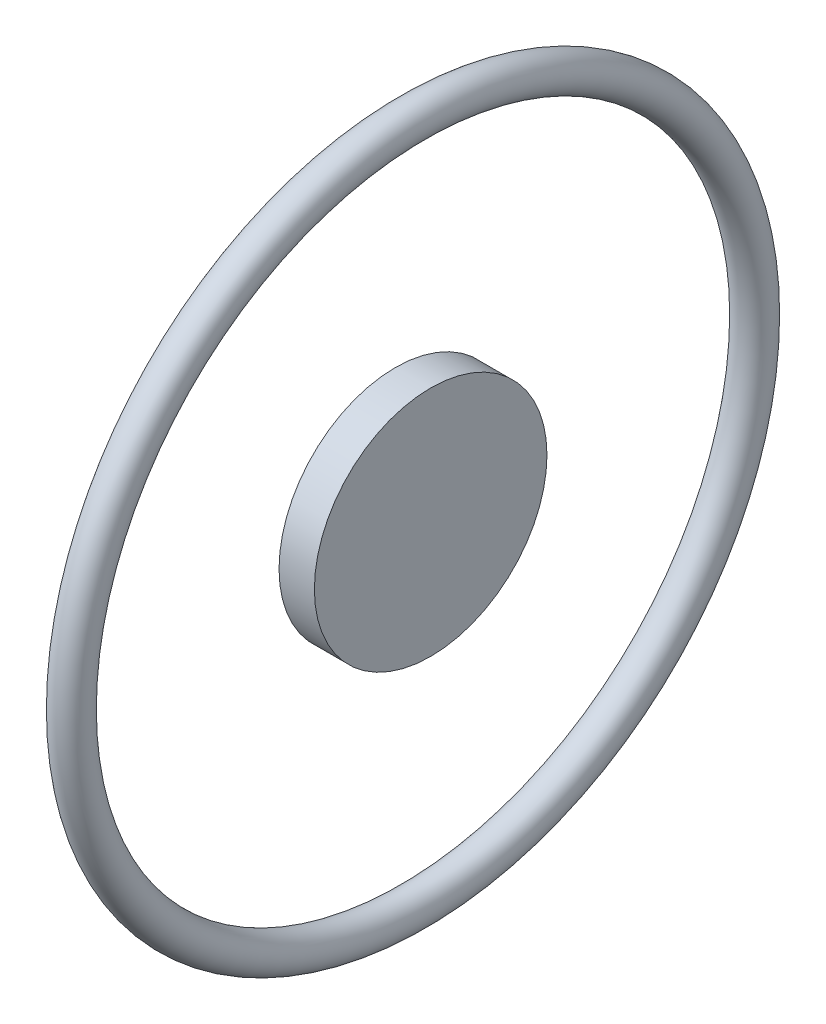
ISO-10303-21;
HEADER;
FILE_DESCRIPTION(('STEP AP214'),'2;1');
FILE_NAME('part.step','',(''),(''),'','','');
FILE_SCHEMA(('AUTOMOTIVE_DESIGN { 1 0 10303 214 1 1 1 1 }'));
ENDSEC;
DATA;
#1=APPLICATION_CONTEXT('core data for automotive mechanical design processes');
#2=APPLICATION_PROTOCOL_DEFINITION('international standard','automotive_design',2000,#1);
#3=PRODUCT_CONTEXT('',#1,'mechanical');
#4=PRODUCT('Part','Part','',(#3));
#5=PRODUCT_RELATED_PRODUCT_CATEGORY('part','',(#4));
#6=PRODUCT_DEFINITION_FORMATION('','',#4);
#7=PRODUCT_DEFINITION_CONTEXT('part definition',#1,'design');
#8=PRODUCT_DEFINITION('design','',#6,#7);
#9=PRODUCT_DEFINITION_SHAPE('','',#8);
#10=(LENGTH_UNIT() NAMED_UNIT(*) SI_UNIT(.MILLI.,.METRE.));
#11=(NAMED_UNIT(*) PLANE_ANGLE_UNIT() SI_UNIT($,.RADIAN.));
#12=(NAMED_UNIT(*) SI_UNIT($,.STERADIAN.) SOLID_ANGLE_UNIT());
#13=UNCERTAINTY_MEASURE_WITH_UNIT(LENGTH_MEASURE(1.E-05),#10,'distance_accuracy_value','');
#14=(GEOMETRIC_REPRESENTATION_CONTEXT(3) GLOBAL_UNCERTAINTY_ASSIGNED_CONTEXT((#13)) GLOBAL_UNIT_ASSIGNED_CONTEXT((#10,
#11,#12)) REPRESENTATION_CONTEXT('',''));
#15=CARTESIAN_POINT('',(0.,0.,0.));
#16=DIRECTION('',(0.,0.,1.));
#17=DIRECTION('',(1.,0.,0.));
#18=AXIS2_PLACEMENT_3D('',#15,#16,#17);
#19=CARTESIAN_POINT('',(0.,0.,0.));
#20=DIRECTION('',(-1.,0.,0.));
#21=DIRECTION('',(0.,0.,1.));
#22=AXIS2_PLACEMENT_3D('',#19,#20,#21);
#23=TOROIDAL_SURFACE('',#22,14.5,0.750000000000001);
#24=ADVANCED_FACE('P0_F13',(),#23,.T.);
#25=CLOSED_SHELL('',(#24));
#26=MANIFOLD_SOLID_BREP('P0_B1',#25);
#27=CARTESIAN_POINT('',(0.75,0.,0.));
#28=DIRECTION('',(1.,0.,0.));
#29=DIRECTION('',(0.,0.,-1.));
#30=AXIS2_PLACEMENT_3D('',#27,#28,#29);
#31=PLANE('',#30);
#32=CARTESIAN_POINT('',(0.75,0.,0.));
#33=DIRECTION('',(1.,0.,0.));
#34=DIRECTION('',(0.,0.,-1.));
#35=AXIS2_PLACEMENT_3D('',#32,#33,#34);
#36=CIRCLE('',#35,4.93576873413722);
#37=CARTESIAN_POINT('',(0.75,0.,-4.93576873413722));
#38=VERTEX_POINT('',#37);
#39=EDGE_CURVE('P1_E17',#38,#38,#36,.F.);
#40=ORIENTED_EDGE('',*,*,#39,.F.);
#41=EDGE_LOOP('',(#40));
#42=FACE_BOUND('',#41,.T.);
#43=ADVANCED_FACE('P1_F14',(#42),#31,.T.);
#44=CARTESIAN_POINT('',(-0.75,0.,0.));
#45=DIRECTION('',(1.,0.,0.));
#46=DIRECTION('',(0.,0.,-1.));
#47=AXIS2_PLACEMENT_3D('',#44,#45,#46);
#48=CYLINDRICAL_SURFACE('',#47,4.93576873413722);
#49=ORIENTED_EDGE('',*,*,#39,.T.);
#50=EDGE_LOOP('',(#49));
#51=FACE_BOUND('',#50,.T.);
#52=CARTESIAN_POINT('',(-0.75,0.,0.));
#53=DIRECTION('',(1.,0.,0.));
#54=DIRECTION('',(0.,0.,-1.));
#55=AXIS2_PLACEMENT_3D('',#52,#53,#54);
#56=CIRCLE('',#55,4.93576873413722);
#57=CARTESIAN_POINT('',(-0.75,0.,-4.93576873413722));
#58=VERTEX_POINT('',#57);
#59=EDGE_CURVE('P1_E10',#58,#58,#56,.F.);
#60=ORIENTED_EDGE('',*,*,#59,.F.);
#61=EDGE_LOOP('',(#60));
#62=FACE_BOUND('',#61,.T.);
#63=ADVANCED_FACE('P1_F26',(#51,#62),#48,.T.);
#64=CARTESIAN_POINT('',(-0.75,0.,0.));
#65=DIRECTION('',(-1.,0.,0.));
#66=DIRECTION('',(0.,0.,1.));
#67=AXIS2_PLACEMENT_3D('',#64,#65,#66);
#68=PLANE('',#67);
#69=ORIENTED_EDGE('',*,*,#59,.T.);
#70=EDGE_LOOP('',(#69));
#71=FACE_BOUND('',#70,.T.);
#72=ADVANCED_FACE('P1_F34',(#71),#68,.T.);
#73=CLOSED_SHELL('',(#43,#63,#72));
#74=MANIFOLD_SOLID_BREP('P1_B1',#73);
#75=ADVANCED_BREP_SHAPE_REPRESENTATION('',(#18,#26,#74),#14);
#76=SHAPE_DEFINITION_REPRESENTATION(#9,#75);
ENDSEC;
END-ISO-10303-21;
